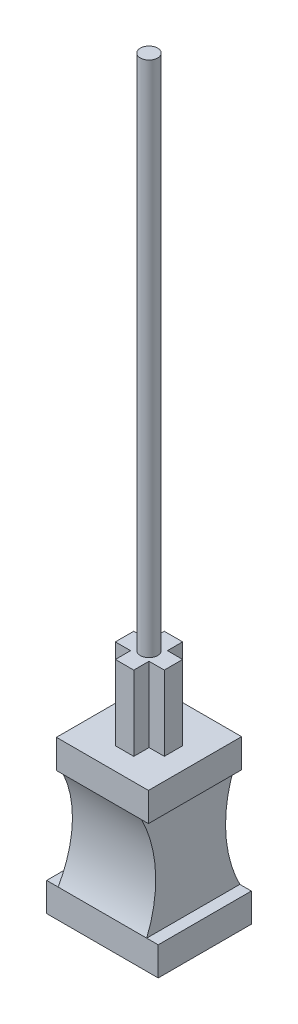
ISO-10303-21;
HEADER;
FILE_DESCRIPTION(('STEP AP214'),'2;1');
FILE_NAME('part.step','',(''),(''),'','','');
FILE_SCHEMA(('AUTOMOTIVE_DESIGN { 1 0 10303 214 1 1 1 1 }'));
ENDSEC;
DATA;
#1=APPLICATION_CONTEXT('core data for automotive mechanical design processes');
#2=APPLICATION_PROTOCOL_DEFINITION('international standard','automotive_design',2000,#1);
#3=PRODUCT_CONTEXT('',#1,'mechanical');
#4=PRODUCT('Part','Part','',(#3));
#5=PRODUCT_RELATED_PRODUCT_CATEGORY('part','',(#4));
#6=PRODUCT_DEFINITION_FORMATION('','',#4);
#7=PRODUCT_DEFINITION_CONTEXT('part definition',#1,'design');
#8=PRODUCT_DEFINITION('design','',#6,#7);
#9=PRODUCT_DEFINITION_SHAPE('','',#8);
#10=(LENGTH_UNIT() NAMED_UNIT(*) SI_UNIT(.MILLI.,.METRE.));
#11=(NAMED_UNIT(*) PLANE_ANGLE_UNIT() SI_UNIT($,.RADIAN.));
#12=(NAMED_UNIT(*) SI_UNIT($,.STERADIAN.) SOLID_ANGLE_UNIT());
#13=UNCERTAINTY_MEASURE_WITH_UNIT(LENGTH_MEASURE(1.E-05),#10,'distance_accuracy_value','');
#14=(GEOMETRIC_REPRESENTATION_CONTEXT(3) GLOBAL_UNCERTAINTY_ASSIGNED_CONTEXT((#13)) GLOBAL_UNIT_ASSIGNED_CONTEXT((#10,
#11,#12)) REPRESENTATION_CONTEXT('',''));
#15=CARTESIAN_POINT('',(0.,0.,0.));
#16=DIRECTION('',(0.,0.,1.));
#17=DIRECTION('',(1.,0.,0.));
#18=AXIS2_PLACEMENT_3D('',#15,#16,#17);
#19=CARTESIAN_POINT('',(0.85,13.7,8.1));
#20=DIRECTION('',(0.,1.,0.));
#21=DIRECTION('',(-1.,0.,0.));
#22=AXIS2_PLACEMENT_3D('',#19,#20,#21);
#23=PLANE('',#22);
#24=DIRECTION('',(1.,0.,0.));
#25=VECTOR('',#24,1.);
#26=CARTESIAN_POINT('',(0.85,13.7,0.));
#27=LINE('',#26,#25);
#28=CARTESIAN_POINT('',(0.85,13.7,0.));
#29=VERTEX_POINT('',#28);
#30=CARTESIAN_POINT('',(8.85,13.7,0.));
#31=VERTEX_POINT('',#30);
#32=EDGE_CURVE('E300',#29,#31,#27,.T.);
#33=ORIENTED_EDGE('',*,*,#32,.F.);
#34=DIRECTION('',(0.,0.,-1.));
#35=VECTOR('',#34,1.);
#36=CARTESIAN_POINT('',(0.85,13.7,8.1));
#37=LINE('',#36,#35);
#38=CARTESIAN_POINT('',(0.85,13.7,8.1));
#39=VERTEX_POINT('',#38);
#40=EDGE_CURVE('E347',#39,#29,#37,.T.);
#41=ORIENTED_EDGE('',*,*,#40,.F.);
#42=DIRECTION('',(1.,0.,0.));
#43=VECTOR('',#42,1.);
#44=CARTESIAN_POINT('',(0.85,13.7,8.1));
#45=LINE('',#44,#43);
#46=CARTESIAN_POINT('',(8.85,13.7,8.1));
#47=VERTEX_POINT('',#46);
#48=EDGE_CURVE('E267',#39,#47,#45,.T.);
#49=ORIENTED_EDGE('',*,*,#48,.T.);
#50=DIRECTION('',(0.,0.,-1.));
#51=VECTOR('',#50,1.);
#52=CARTESIAN_POINT('',(8.85,13.7,8.1));
#53=LINE('',#52,#51);
#54=EDGE_CURVE('E345',#47,#31,#53,.T.);
#55=ORIENTED_EDGE('',*,*,#54,.T.);
#56=EDGE_LOOP('',(#33,#41,#49,#55));
#57=FACE_BOUND('',#56,.T.);
#58=DIRECTION('',(0.,0.,-1.));
#59=VECTOR('',#58,1.);
#60=CARTESIAN_POINT('',(5.65,13.7,3.25));
#61=LINE('',#60,#59);
#62=CARTESIAN_POINT('',(5.65,13.7,3.25));
#63=VERTEX_POINT('',#62);
#64=CARTESIAN_POINT('',(5.65,13.7,1.925));
#65=VERTEX_POINT('',#64);
#66=EDGE_CURVE('E999',#63,#65,#61,.T.);
#67=ORIENTED_EDGE('',*,*,#66,.F.);
#68=DIRECTION('',(-1.,0.,0.));
#69=VECTOR('',#68,1.);
#70=CARTESIAN_POINT('',(6.975,13.7,3.25));
#71=LINE('',#70,#69);
#72=CARTESIAN_POINT('',(6.975,13.7,3.25));
#73=VERTEX_POINT('',#72);
#74=EDGE_CURVE('E217',#73,#63,#71,.T.);
#75=ORIENTED_EDGE('',*,*,#74,.F.);
#76=DIRECTION('',(0.,0.,-1.));
#77=VECTOR('',#76,1.);
#78=CARTESIAN_POINT('',(6.975,13.7,4.84297343910806));
#79=LINE('',#78,#77);
#80=CARTESIAN_POINT('',(6.975,13.7,4.84297343910806));
#81=VERTEX_POINT('',#80);
#82=EDGE_CURVE('E213',#81,#73,#79,.T.);
#83=ORIENTED_EDGE('',*,*,#82,.F.);
#84=DIRECTION('',(0.999985939048307,0.,-0.00530299025796794));
#85=VECTOR('',#84,1.);
#86=CARTESIAN_POINT('',(5.65,13.7,4.85));
#87=LINE('',#86,#85);
#88=CARTESIAN_POINT('',(5.65,13.7,4.85));
#89=VERTEX_POINT('',#88);
#90=EDGE_CURVE('E1050',#89,#81,#87,.T.);
#91=ORIENTED_EDGE('',*,*,#90,.F.);
#92=DIRECTION('',(0.,0.,-1.));
#93=VECTOR('',#92,1.);
#94=CARTESIAN_POINT('',(5.65,13.7,6.175));
#95=LINE('',#94,#93);
#96=CARTESIAN_POINT('',(5.65,13.7,6.175));
#97=VERTEX_POINT('',#96);
#98=EDGE_CURVE('E1047',#97,#89,#95,.T.);
#99=ORIENTED_EDGE('',*,*,#98,.F.);
#100=DIRECTION('',(1.,0.,0.));
#101=VECTOR('',#100,1.);
#102=CARTESIAN_POINT('',(4.05,13.7,6.175));
#103=LINE('',#102,#101);
#104=CARTESIAN_POINT('',(4.05,13.7,6.175));
#105=VERTEX_POINT('',#104);
#106=EDGE_CURVE('E1044',#105,#97,#103,.T.);
#107=ORIENTED_EDGE('',*,*,#106,.F.);
#108=DIRECTION('',(0.,0.,1.));
#109=VECTOR('',#108,1.);
#110=CARTESIAN_POINT('',(4.05,13.7,4.85));
#111=LINE('',#110,#109);
#112=CARTESIAN_POINT('',(4.05,13.7,4.85));
#113=VERTEX_POINT('',#112);
#114=EDGE_CURVE('E1041',#113,#105,#111,.T.);
#115=ORIENTED_EDGE('',*,*,#114,.F.);
#116=DIRECTION('',(0.999997114626677,0.,-0.00240223610861155));
#117=VECTOR('',#116,1.);
#118=CARTESIAN_POINT('',(2.725,13.7,4.85318297202797));
#119=LINE('',#118,#117);
#120=CARTESIAN_POINT('',(2.725,13.7,4.85318297202797));
#121=VERTEX_POINT('',#120);
#122=EDGE_CURVE('E1038',#121,#113,#119,.T.);
#123=ORIENTED_EDGE('',*,*,#122,.F.);
#124=DIRECTION('',(0.,0.,1.));
#125=VECTOR('',#124,1.);
#126=CARTESIAN_POINT('',(2.725,13.7,3.25));
#127=LINE('',#126,#125);
#128=CARTESIAN_POINT('',(2.725,13.7,3.25));
#129=VERTEX_POINT('',#128);
#130=EDGE_CURVE('E1035',#129,#121,#127,.T.);
#131=ORIENTED_EDGE('',*,*,#130,.F.);
#132=DIRECTION('',(-1.,0.,0.));
#133=VECTOR('',#132,1.);
#134=CARTESIAN_POINT('',(4.05,13.7,3.25));
#135=LINE('',#134,#133);
#136=CARTESIAN_POINT('',(4.05,13.7,3.25));
#137=VERTEX_POINT('',#136);
#138=EDGE_CURVE('E1032',#137,#129,#135,.T.);
#139=ORIENTED_EDGE('',*,*,#138,.F.);
#140=DIRECTION('',(0.,0.,1.));
#141=VECTOR('',#140,1.);
#142=CARTESIAN_POINT('',(4.05,13.7,1.925));
#143=LINE('',#142,#141);
#144=CARTESIAN_POINT('',(4.05,13.7,1.925));
#145=VERTEX_POINT('',#144);
#146=EDGE_CURVE('E1029',#145,#137,#143,.T.);
#147=ORIENTED_EDGE('',*,*,#146,.F.);
#148=DIRECTION('',(-1.,0.,0.));
#149=VECTOR('',#148,1.);
#150=CARTESIAN_POINT('',(5.65,13.7,1.925));
#151=LINE('',#150,#149);
#152=EDGE_CURVE('E1026',#65,#145,#151,.T.);
#153=ORIENTED_EDGE('',*,*,#152,.F.);
#154=EDGE_LOOP('',(#67,#75,#83,#91,#99,#107,#115,#123,#131,#139,#147,#153));
#155=FACE_BOUND('',#154,.T.);
#156=ADVANCED_FACE('F15',(#57,#155),#23,.T.);
#157=CARTESIAN_POINT('',(0.,0.,8.1));
#158=DIRECTION('',(0.,0.,1.));
#159=DIRECTION('',(1.,0.,0.));
#160=AXIS2_PLACEMENT_3D('',#157,#158,#159);
#161=PLANE('',#160);
#162=DIRECTION('',(-1.,0.,0.));
#163=VECTOR('',#162,1.);
#164=CARTESIAN_POINT('',(13.089618817433,11.2,8.1));
#165=LINE('',#164,#163);
#166=CARTESIAN_POINT('',(8.23941176470588,11.2,8.1));
#167=VERTEX_POINT('',#166);
#168=CARTESIAN_POINT('',(1.46058823529412,11.2,8.1));
#169=VERTEX_POINT('',#168);
#170=EDGE_CURVE('E244',#167,#169,#165,.T.);
#171=ORIENTED_EDGE('',*,*,#170,.F.);
#172=DIRECTION('',(-1.,0.,0.));
#173=VECTOR('',#172,1.);
#174=CARTESIAN_POINT('',(8.85,11.2,8.1));
#175=LINE('',#174,#173);
#176=CARTESIAN_POINT('',(8.85,11.2,8.1));
#177=VERTEX_POINT('',#176);
#178=EDGE_CURVE('E273',#177,#167,#175,.T.);
#179=ORIENTED_EDGE('',*,*,#178,.F.);
#180=DIRECTION('',(0.,-1.,0.));
#181=VECTOR('',#180,1.);
#182=CARTESIAN_POINT('',(8.85,11.2,8.1));
#183=LINE('',#182,#181);
#184=EDGE_CURVE('E270',#47,#177,#183,.T.);
#185=ORIENTED_EDGE('',*,*,#184,.F.);
#186=ORIENTED_EDGE('',*,*,#48,.F.);
#187=DIRECTION('',(0.,1.,0.));
#188=VECTOR('',#187,1.);
#189=CARTESIAN_POINT('',(0.85,13.7,8.1));
#190=LINE('',#189,#188);
#191=CARTESIAN_POINT('',(0.850000000000001,11.2,8.1));
#192=VERTEX_POINT('',#191);
#193=EDGE_CURVE('E263',#192,#39,#190,.T.);
#194=ORIENTED_EDGE('',*,*,#193,.F.);
#195=DIRECTION('',(-1.,0.,0.));
#196=VECTOR('',#195,1.);
#197=CARTESIAN_POINT('',(0.850000000000001,11.2,8.1));
#198=LINE('',#197,#196);
#199=EDGE_CURVE('E260',#169,#192,#198,.T.);
#200=ORIENTED_EDGE('',*,*,#199,.F.);
#201=EDGE_LOOP('',(#171,#179,#185,#186,#194,#200));
#202=FACE_BOUND('',#201,.T.);
#203=ADVANCED_FACE('F384',(#202),#161,.T.);
#204=CARTESIAN_POINT('',(0.,0.,0.));
#205=DIRECTION('',(0.,0.,1.));
#206=DIRECTION('',(1.,0.,0.));
#207=AXIS2_PLACEMENT_3D('',#204,#205,#206);
#208=PLANE('',#207);
#209=DIRECTION('',(-1.,0.,0.));
#210=VECTOR('',#209,1.);
#211=CARTESIAN_POINT('',(8.85,11.2,0.));
#212=LINE('',#211,#210);
#213=CARTESIAN_POINT('',(8.85,11.2,0.));
#214=VERTEX_POINT('',#213);
#215=CARTESIAN_POINT('',(8.23941176470588,11.2,0.));
#216=VERTEX_POINT('',#215);
#217=EDGE_CURVE('E308',#214,#216,#212,.T.);
#218=ORIENTED_EDGE('',*,*,#217,.T.);
#219=DIRECTION('',(-1.,0.,0.));
#220=VECTOR('',#219,1.);
#221=CARTESIAN_POINT('',(13.089618817433,11.2,0.));
#222=LINE('',#221,#220);
#223=CARTESIAN_POINT('',(1.46058823529412,11.2,0.));
#224=VERTEX_POINT('',#223);
#225=EDGE_CURVE('E241',#216,#224,#222,.T.);
#226=ORIENTED_EDGE('',*,*,#225,.T.);
#227=DIRECTION('',(-1.,0.,0.));
#228=VECTOR('',#227,1.);
#229=CARTESIAN_POINT('',(0.850000000000001,11.2,0.));
#230=LINE('',#229,#228);
#231=CARTESIAN_POINT('',(0.850000000000001,11.2,0.));
#232=VERTEX_POINT('',#231);
#233=EDGE_CURVE('E292',#224,#232,#230,.T.);
#234=ORIENTED_EDGE('',*,*,#233,.T.);
#235=DIRECTION('',(0.,1.,0.));
#236=VECTOR('',#235,1.);
#237=CARTESIAN_POINT('',(0.85,13.7,0.));
#238=LINE('',#237,#236);
#239=EDGE_CURVE('E296',#232,#29,#238,.T.);
#240=ORIENTED_EDGE('',*,*,#239,.T.);
#241=ORIENTED_EDGE('',*,*,#32,.T.);
#242=DIRECTION('',(0.,-1.,0.));
#243=VECTOR('',#242,1.);
#244=CARTESIAN_POINT('',(8.85,11.2,0.));
#245=LINE('',#244,#243);
#246=EDGE_CURVE('E304',#31,#214,#245,.T.);
#247=ORIENTED_EDGE('',*,*,#246,.T.);
#248=EDGE_LOOP('',(#218,#226,#234,#240,#241,#247));
#249=FACE_BOUND('',#248,.T.);
#250=ADVANCED_FACE('F390',(#249),#208,.F.);
#251=CARTESIAN_POINT('',(0.,2.5,8.1));
#252=DIRECTION('',(0.,1.,0.));
#253=DIRECTION('',(0.,0.,1.));
#254=AXIS2_PLACEMENT_3D('',#251,#252,#253);
#255=PLANE('',#254);
#256=DIRECTION('',(1.,0.,0.));
#257=VECTOR('',#256,1.);
#258=CARTESIAN_POINT('',(0.,2.5,0.));
#259=LINE('',#258,#257);
#260=CARTESIAN_POINT('',(0.,2.5,0.));
#261=VERTEX_POINT('',#260);
#262=CARTESIAN_POINT('',(1.,2.5,0.));
#263=VERTEX_POINT('',#262);
#264=EDGE_CURVE('E259',#261,#263,#259,.T.);
#265=ORIENTED_EDGE('',*,*,#264,.F.);
#266=DIRECTION('',(0.,0.,-1.));
#267=VECTOR('',#266,1.);
#268=CARTESIAN_POINT('',(0.,2.5,8.1));
#269=LINE('',#268,#267);
#270=CARTESIAN_POINT('',(0.,2.5,8.1));
#271=VERTEX_POINT('',#270);
#272=EDGE_CURVE('E288',#271,#261,#269,.T.);
#273=ORIENTED_EDGE('',*,*,#272,.F.);
#274=DIRECTION('',(1.,0.,0.));
#275=VECTOR('',#274,1.);
#276=CARTESIAN_POINT('',(0.,2.5,8.1));
#277=LINE('',#276,#275);
#278=CARTESIAN_POINT('',(1.,2.5,8.1));
#279=VERTEX_POINT('',#278);
#280=EDGE_CURVE('E264',#271,#279,#277,.T.);
#281=ORIENTED_EDGE('',*,*,#280,.T.);
#282=DIRECTION('',(0.,0.,-1.));
#283=VECTOR('',#282,1.);
#284=CARTESIAN_POINT('',(1.,2.5,8.1));
#285=LINE('',#284,#283);
#286=EDGE_CURVE('E354',#279,#263,#285,.T.);
#287=ORIENTED_EDGE('',*,*,#286,.T.);
#288=EDGE_LOOP('',(#265,#273,#281,#287));
#289=FACE_BOUND('',#288,.T.);
#290=ADVANCED_FACE('F17',(#289),#255,.T.);
#291=CARTESIAN_POINT('',(1.,2.5,8.1));
#292=DIRECTION('',(-0.998601554869442,0.052867141140147,0.));
#293=DIRECTION('',(-0.052867141140147,-0.998601554869442,0.));
#294=AXIS2_PLACEMENT_3D('',#291,#292,#293);
#295=PLANE('',#294);
#296=CARTESIAN_POINT('',(1.23029411764706,6.85,-8.96125000000001));
#297=DIRECTION('',(-0.998601554869442,0.052867141140147,0.));
#298=DIRECTION('',(-0.052867141140147,-0.998601554869442,0.));
#299=AXIS2_PLACEMENT_3D('',#296,#297,#298);
#300=ELLIPSE('',#299,9.97519976954407,9.96125000000001);
#301=EDGE_CURVE('E253',#263,#224,#300,.T.);
#302=ORIENTED_EDGE('',*,*,#301,.F.);
#303=ORIENTED_EDGE('',*,*,#286,.F.);
#304=CARTESIAN_POINT('',(1.23029411764706,6.85,17.06125));
#305=DIRECTION('',(-0.998601554869442,0.052867141140147,0.));
#306=DIRECTION('',(-0.052867141140147,-0.998601554869442,0.));
#307=AXIS2_PLACEMENT_3D('',#304,#305,#306);
#308=ELLIPSE('',#307,9.97519976954405,9.96124999999999);
#309=EDGE_CURVE('E257',#169,#279,#308,.T.);
#310=ORIENTED_EDGE('',*,*,#309,.F.);
#311=DIRECTION('',(0.,0.,-1.));
#312=VECTOR('',#311,1.);
#313=CARTESIAN_POINT('',(1.46058823529412,11.2,8.1));
#314=LINE('',#313,#312);
#315=EDGE_CURVE('E351',#169,#224,#314,.T.);
#316=ORIENTED_EDGE('',*,*,#315,.T.);
#317=EDGE_LOOP('',(#302,#303,#310,#316));
#318=FACE_BOUND('',#317,.T.);
#319=ADVANCED_FACE('F406',(#318),#295,.T.);
#320=CARTESIAN_POINT('',(0.850000000000001,11.2,8.1));
#321=DIRECTION('',(0.,-1.,0.));
#322=DIRECTION('',(1.,0.,0.));
#323=AXIS2_PLACEMENT_3D('',#320,#321,#322);
#324=PLANE('',#323);
#325=ORIENTED_EDGE('',*,*,#233,.F.);
#326=ORIENTED_EDGE('',*,*,#315,.F.);
#327=ORIENTED_EDGE('',*,*,#199,.T.);
#328=DIRECTION('',(0.,0.,-1.));
#329=VECTOR('',#328,1.);
#330=CARTESIAN_POINT('',(0.850000000000001,11.2,8.1));
#331=LINE('',#330,#329);
#332=EDGE_CURVE('E349',#192,#232,#331,.T.);
#333=ORIENTED_EDGE('',*,*,#332,.T.);
#334=EDGE_LOOP('',(#325,#326,#327,#333));
#335=FACE_BOUND('',#334,.T.);
#336=ADVANCED_FACE('F403',(#335),#324,.T.);
#337=CARTESIAN_POINT('',(0.85,13.7,8.1));
#338=DIRECTION('',(-1.,0.,0.));
#339=DIRECTION('',(0.,-1.,0.));
#340=AXIS2_PLACEMENT_3D('',#337,#338,#339);
#341=PLANE('',#340);
#342=ORIENTED_EDGE('',*,*,#239,.F.);
#343=ORIENTED_EDGE('',*,*,#332,.F.);
#344=ORIENTED_EDGE('',*,*,#193,.T.);
#345=ORIENTED_EDGE('',*,*,#40,.T.);
#346=EDGE_LOOP('',(#342,#343,#344,#345));
#347=FACE_BOUND('',#346,.T.);
#348=ADVANCED_FACE('F400',(#347),#341,.T.);
#349=CARTESIAN_POINT('',(8.85,11.2,8.1));
#350=DIRECTION('',(1.,0.,0.));
#351=DIRECTION('',(0.,0.,-1.));
#352=AXIS2_PLACEMENT_3D('',#349,#350,#351);
#353=PLANE('',#352);
#354=ORIENTED_EDGE('',*,*,#246,.F.);
#355=ORIENTED_EDGE('',*,*,#54,.F.);
#356=ORIENTED_EDGE('',*,*,#184,.T.);
#357=DIRECTION('',(0.,0.,-1.));
#358=VECTOR('',#357,1.);
#359=CARTESIAN_POINT('',(8.85,11.2,8.1));
#360=LINE('',#359,#358);
#361=EDGE_CURVE('E343',#177,#214,#360,.T.);
#362=ORIENTED_EDGE('',*,*,#361,.T.);
#363=EDGE_LOOP('',(#354,#355,#356,#362));
#364=FACE_BOUND('',#363,.T.);
#365=ADVANCED_FACE('F398',(#364),#353,.T.);
#366=CARTESIAN_POINT('',(8.85,11.2,8.1));
#367=DIRECTION('',(0.,-1.,0.));
#368=DIRECTION('',(0.,0.,-1.));
#369=AXIS2_PLACEMENT_3D('',#366,#367,#368);
#370=PLANE('',#369);
#371=ORIENTED_EDGE('',*,*,#217,.F.);
#372=ORIENTED_EDGE('',*,*,#361,.F.);
#373=ORIENTED_EDGE('',*,*,#178,.T.);
#374=DIRECTION('',(0.,0.,-1.));
#375=VECTOR('',#374,1.);
#376=CARTESIAN_POINT('',(8.23941176470588,11.2,8.1));
#377=LINE('',#376,#375);
#378=EDGE_CURVE('E340',#167,#216,#377,.T.);
#379=ORIENTED_EDGE('',*,*,#378,.T.);
#380=EDGE_LOOP('',(#371,#372,#373,#379));
#381=FACE_BOUND('',#380,.T.);
#382=ADVANCED_FACE('F463',(#381),#370,.T.);
#383=CARTESIAN_POINT('',(8.7,2.5,8.1));
#384=DIRECTION('',(0.998601554869442,0.0528671411401469,0.));
#385=DIRECTION('',(-0.0528671411401469,0.998601554869442,0.));
#386=AXIS2_PLACEMENT_3D('',#383,#384,#385);
#387=PLANE('',#386);
#388=CARTESIAN_POINT('',(8.46970588235294,6.85,-8.96125000000001));
#389=DIRECTION('',(0.998601554869442,0.0528671411401469,0.));
#390=DIRECTION('',(-0.0528671411401469,0.998601554869442,0.));
#391=AXIS2_PLACEMENT_3D('',#388,#389,#390);
#392=ELLIPSE('',#391,9.97519976954407,9.96125000000001);
#393=CARTESIAN_POINT('',(8.7,2.5,0.));
#394=VERTEX_POINT('',#393);
#395=EDGE_CURVE('E251',#216,#394,#392,.T.);
#396=ORIENTED_EDGE('',*,*,#395,.F.);
#397=ORIENTED_EDGE('',*,*,#378,.F.);
#398=CARTESIAN_POINT('',(8.46970588235294,6.85,17.06125));
#399=DIRECTION('',(0.998601554869442,0.0528671411401469,0.));
#400=DIRECTION('',(-0.0528671411401469,0.998601554869442,0.));
#401=AXIS2_PLACEMENT_3D('',#398,#399,#400);
#402=ELLIPSE('',#401,9.97519976954405,9.96124999999999);
#403=CARTESIAN_POINT('',(8.7,2.5,8.1));
#404=VERTEX_POINT('',#403);
#405=EDGE_CURVE('E255',#404,#167,#402,.T.);
#406=ORIENTED_EDGE('',*,*,#405,.F.);
#407=DIRECTION('',(0.,0.,-1.));
#408=VECTOR('',#407,1.);
#409=CARTESIAN_POINT('',(8.7,2.5,8.1));
#410=LINE('',#409,#408);
#411=EDGE_CURVE('E337',#404,#394,#410,.T.);
#412=ORIENTED_EDGE('',*,*,#411,.T.);
#413=EDGE_LOOP('',(#396,#397,#406,#412));
#414=FACE_BOUND('',#413,.T.);
#415=ADVANCED_FACE('F441',(#414),#387,.T.);
#416=CARTESIAN_POINT('',(9.7,2.5,8.1));
#417=DIRECTION('',(0.,1.,0.));
#418=DIRECTION('',(0.,0.,1.));
#419=AXIS2_PLACEMENT_3D('',#416,#417,#418);
#420=PLANE('',#419);
#421=DIRECTION('',(1.,0.,0.));
#422=VECTOR('',#421,1.);
#423=CARTESIAN_POINT('',(9.7,2.5,0.));
#424=LINE('',#423,#422);
#425=CARTESIAN_POINT('',(9.7,2.5,0.));
#426=VERTEX_POINT('',#425);
#427=EDGE_CURVE('E312',#394,#426,#424,.T.);
#428=ORIENTED_EDGE('',*,*,#427,.F.);
#429=ORIENTED_EDGE('',*,*,#411,.F.);
#430=DIRECTION('',(1.,0.,0.));
#431=VECTOR('',#430,1.);
#432=CARTESIAN_POINT('',(9.7,2.5,8.1));
#433=LINE('',#432,#431);
#434=CARTESIAN_POINT('',(9.7,2.5,8.1));
#435=VERTEX_POINT('',#434);
#436=EDGE_CURVE('E276',#404,#435,#433,.T.);
#437=ORIENTED_EDGE('',*,*,#436,.T.);
#438=DIRECTION('',(0.,0.,-1.));
#439=VECTOR('',#438,1.);
#440=CARTESIAN_POINT('',(9.7,2.5,8.1));
#441=LINE('',#440,#439);
#442=EDGE_CURVE('E335',#435,#426,#441,.T.);
#443=ORIENTED_EDGE('',*,*,#442,.T.);
#444=EDGE_LOOP('',(#428,#429,#437,#443));
#445=FACE_BOUND('',#444,.T.);
#446=ADVANCED_FACE('F444',(#445),#420,.T.);
#447=CARTESIAN_POINT('',(9.7,0.,8.1));
#448=DIRECTION('',(1.,0.,0.));
#449=DIRECTION('',(0.,0.,-1.));
#450=AXIS2_PLACEMENT_3D('',#447,#448,#449);
#451=PLANE('',#450);
#452=DIRECTION('',(0.,-1.,0.));
#453=VECTOR('',#452,1.);
#454=CARTESIAN_POINT('',(9.7,0.,0.));
#455=LINE('',#454,#453);
#456=CARTESIAN_POINT('',(9.7,0.,0.));
#457=VERTEX_POINT('',#456);
#458=EDGE_CURVE('E316',#426,#457,#455,.T.);
#459=ORIENTED_EDGE('',*,*,#458,.F.);
#460=ORIENTED_EDGE('',*,*,#442,.F.);
#461=DIRECTION('',(0.,-1.,0.));
#462=VECTOR('',#461,1.);
#463=CARTESIAN_POINT('',(9.7,0.,8.1));
#464=LINE('',#463,#462);
#465=CARTESIAN_POINT('',(9.7,0.,8.1));
#466=VERTEX_POINT('',#465);
#467=EDGE_CURVE('E279',#435,#466,#464,.T.);
#468=ORIENTED_EDGE('',*,*,#467,.T.);
#469=DIRECTION('',(0.,0.,-1.));
#470=VECTOR('',#469,1.);
#471=CARTESIAN_POINT('',(9.7,0.,8.1));
#472=LINE('',#471,#470);
#473=EDGE_CURVE('E333',#466,#457,#472,.T.);
#474=ORIENTED_EDGE('',*,*,#473,.T.);
#475=EDGE_LOOP('',(#459,#460,#468,#474));
#476=FACE_BOUND('',#475,.T.);
#477=ADVANCED_FACE('F447',(#476),#451,.T.);
#478=CARTESIAN_POINT('',(0.,0.,8.1));
#479=DIRECTION('',(0.,-1.,0.));
#480=DIRECTION('',(0.,0.,-1.));
#481=AXIS2_PLACEMENT_3D('',#478,#479,#480);
#482=PLANE('',#481);
#483=DIRECTION('',(-1.,0.,0.));
#484=VECTOR('',#483,1.);
#485=CARTESIAN_POINT('',(0.,0.,0.));
#486=LINE('',#485,#484);
#487=CARTESIAN_POINT('',(0.,0.,0.));
#488=VERTEX_POINT('',#487);
#489=EDGE_CURVE('E320',#457,#488,#486,.T.);
#490=ORIENTED_EDGE('',*,*,#489,.F.);
#491=ORIENTED_EDGE('',*,*,#473,.F.);
#492=DIRECTION('',(-1.,0.,0.));
#493=VECTOR('',#492,1.);
#494=CARTESIAN_POINT('',(0.,0.,8.1));
#495=LINE('',#494,#493);
#496=CARTESIAN_POINT('',(0.,0.,8.1));
#497=VERTEX_POINT('',#496);
#498=EDGE_CURVE('E282',#466,#497,#495,.T.);
#499=ORIENTED_EDGE('',*,*,#498,.T.);
#500=DIRECTION('',(0.,0.,-1.));
#501=VECTOR('',#500,1.);
#502=CARTESIAN_POINT('',(0.,0.,8.1));
#503=LINE('',#502,#501);
#504=EDGE_CURVE('E331',#497,#488,#503,.T.);
#505=ORIENTED_EDGE('',*,*,#504,.T.);
#506=EDGE_LOOP('',(#490,#491,#499,#505));
#507=FACE_BOUND('',#506,.T.);
#508=ADVANCED_FACE('F449',(#507),#482,.T.);
#509=CARTESIAN_POINT('',(0.,2.5,8.1));
#510=DIRECTION('',(-1.,0.,0.));
#511=DIRECTION('',(0.,-1.,0.));
#512=AXIS2_PLACEMENT_3D('',#509,#510,#511);
#513=PLANE('',#512);
#514=DIRECTION('',(0.,1.,0.));
#515=VECTOR('',#514,1.);
#516=CARTESIAN_POINT('',(0.,2.5,0.));
#517=LINE('',#516,#515);
#518=EDGE_CURVE('E291',#488,#261,#517,.T.);
#519=ORIENTED_EDGE('',*,*,#518,.F.);
#520=ORIENTED_EDGE('',*,*,#504,.F.);
#521=DIRECTION('',(0.,1.,0.));
#522=VECTOR('',#521,1.);
#523=CARTESIAN_POINT('',(0.,2.5,8.1));
#524=LINE('',#523,#522);
#525=EDGE_CURVE('E285',#497,#271,#524,.T.);
#526=ORIENTED_EDGE('',*,*,#525,.T.);
#527=ORIENTED_EDGE('',*,*,#272,.T.);
#528=EDGE_LOOP('',(#519,#520,#526,#527));
#529=FACE_BOUND('',#528,.T.);
#530=ADVANCED_FACE('F427',(#529),#513,.T.);
#531=DIRECTION('',(-1.,0.,0.));
#532=VECTOR('',#531,1.);
#533=CARTESIAN_POINT('',(13.089618817433,2.5,8.1));
#534=LINE('',#533,#532);
#535=EDGE_CURVE('E246',#404,#279,#534,.T.);
#536=ORIENTED_EDGE('',*,*,#535,.T.);
#537=ORIENTED_EDGE('',*,*,#280,.F.);
#538=ORIENTED_EDGE('',*,*,#525,.F.);
#539=ORIENTED_EDGE('',*,*,#498,.F.);
#540=ORIENTED_EDGE('',*,*,#467,.F.);
#541=ORIENTED_EDGE('',*,*,#436,.F.);
#542=EDGE_LOOP('',(#536,#537,#538,#539,#540,#541));
#543=FACE_BOUND('',#542,.T.);
#544=ADVANCED_FACE('F393',(#543),#161,.T.);
#545=ORIENTED_EDGE('',*,*,#264,.T.);
#546=DIRECTION('',(-1.,0.,0.));
#547=VECTOR('',#546,1.);
#548=CARTESIAN_POINT('',(13.089618817433,2.5,0.));
#549=LINE('',#548,#547);
#550=EDGE_CURVE('E249',#394,#263,#549,.T.);
#551=ORIENTED_EDGE('',*,*,#550,.F.);
#552=ORIENTED_EDGE('',*,*,#427,.T.);
#553=ORIENTED_EDGE('',*,*,#458,.T.);
#554=ORIENTED_EDGE('',*,*,#489,.T.);
#555=ORIENTED_EDGE('',*,*,#518,.T.);
#556=EDGE_LOOP('',(#545,#551,#552,#553,#554,#555));
#557=FACE_BOUND('',#556,.T.);
#558=ADVANCED_FACE('F423',(#557),#208,.F.);
#559=CARTESIAN_POINT('',(13.089618817433,6.85,-8.96125000000001));
#560=DIRECTION('',(-1.,0.,0.));
#561=DIRECTION('',(0.,0.,1.));
#562=AXIS2_PLACEMENT_3D('',#559,#560,#561);
#563=CYLINDRICAL_SURFACE('',#562,9.96125000000001);
#564=CARTESIAN_POINT('',(6.1,6.85,-8.96125000000001));
#565=DIRECTION('',(0.949945114877179,0.312416834887274,0.));
#566=DIRECTION('',(-0.312416834887274,0.949945114877179,0.));
#567=AXIS2_PLACEMENT_3D('',#564,#565,#566);
#568=ELLIPSE('',#567,10.486132139632,9.96125000000001);
#569=CARTESIAN_POINT('',(6.1,6.85,0.999999999999999));
#570=VERTEX_POINT('',#569);
#571=CARTESIAN_POINT('',(4.85,10.650791958042,0.246381728853167));
#572=VERTEX_POINT('',#571);
#573=EDGE_CURVE('E23',#570,#572,#568,.F.);
#574=ORIENTED_EDGE('',*,*,#573,.T.);
#575=CARTESIAN_POINT('',(3.6,6.85,-8.96125000000001));
#576=DIRECTION('',(-0.949945114877179,0.312416834887274,0.));
#577=DIRECTION('',(-0.312416834887274,-0.949945114877179,0.));
#578=AXIS2_PLACEMENT_3D('',#575,#576,#577);
#579=ELLIPSE('',#578,10.486132139632,9.96125000000001);
#580=CARTESIAN_POINT('',(3.6,6.85,0.999999999999999));
#581=VERTEX_POINT('',#580);
#582=EDGE_CURVE('E9',#572,#581,#579,.F.);
#583=ORIENTED_EDGE('',*,*,#582,.T.);
#584=DIRECTION('',(-1.,0.,0.));
#585=VECTOR('',#584,1.);
#586=CARTESIAN_POINT('',(13.089618817433,6.85,0.999999999999999));
#587=LINE('',#586,#585);
#588=EDGE_CURVE('E357',#581,#570,#587,.F.);
#589=ORIENTED_EDGE('',*,*,#588,.T.);
#590=EDGE_LOOP('',(#574,#583,#589));
#591=FACE_BOUND('',#590,.T.);
#592=ORIENTED_EDGE('',*,*,#301,.T.);
#593=ORIENTED_EDGE('',*,*,#225,.F.);
#594=ORIENTED_EDGE('',*,*,#395,.T.);
#595=ORIENTED_EDGE('',*,*,#550,.T.);
#596=EDGE_LOOP('',(#592,#593,#594,#595));
#597=FACE_BOUND('',#596,.T.);
#598=ADVANCED_FACE('F361',(#591,#597),#563,.F.);
#599=CARTESIAN_POINT('',(13.089618817433,6.85,17.06125));
#600=DIRECTION('',(-1.,0.,0.));
#601=DIRECTION('',(0.,0.,1.));
#602=AXIS2_PLACEMENT_3D('',#599,#600,#601);
#603=CYLINDRICAL_SURFACE('',#602,9.96124999999999);
#604=ORIENTED_EDGE('',*,*,#309,.T.);
#605=ORIENTED_EDGE('',*,*,#535,.F.);
#606=ORIENTED_EDGE('',*,*,#405,.T.);
#607=ORIENTED_EDGE('',*,*,#170,.T.);
#608=EDGE_LOOP('',(#604,#605,#606,#607));
#609=FACE_BOUND('',#608,.T.);
#610=ADVANCED_FACE('F435',(#609),#603,.F.);
#611=CARTESIAN_POINT('',(3.6,6.85,2.61222283925827));
#612=DIRECTION('',(-0.949945114877179,0.312416834887274,0.));
#613=DIRECTION('',(-0.312416834887274,-0.949945114877179,0.));
#614=AXIS2_PLACEMENT_3D('',#611,#612,#613);
#615=PLANE('',#614);
#616=ORIENTED_EDGE('',*,*,#582,.F.);
#617=DIRECTION('',(0.,0.,-1.));
#618=VECTOR('',#617,1.);
#619=CARTESIAN_POINT('',(4.85,10.650791958042,2.61222283925827));
#620=LINE('',#619,#618);
#621=CARTESIAN_POINT('',(4.85,10.650791958042,0.));
#622=VERTEX_POINT('',#621);
#623=EDGE_CURVE('E237',#572,#622,#620,.T.);
#624=ORIENTED_EDGE('',*,*,#623,.T.);
#625=DIRECTION('',(0.312416834887274,0.949945114877179,0.));
#626=VECTOR('',#625,1.);
#627=CARTESIAN_POINT('',(3.6,6.85,0.));
#628=LINE('',#627,#626);
#629=CARTESIAN_POINT('',(3.6,6.85,0.));
#630=VERTEX_POINT('',#629);
#631=EDGE_CURVE('E219',#630,#622,#628,.T.);
#632=ORIENTED_EDGE('',*,*,#631,.F.);
#633=DIRECTION('',(0.,0.,-1.));
#634=VECTOR('',#633,1.);
#635=CARTESIAN_POINT('',(3.6,6.85,2.61222283925827));
#636=LINE('',#635,#634);
#637=EDGE_CURVE('E239',#581,#630,#636,.T.);
#638=ORIENTED_EDGE('',*,*,#637,.F.);
#639=EDGE_LOOP('',(#616,#624,#632,#638));
#640=FACE_BOUND('',#639,.T.);
#641=ADVANCED_FACE('F369',(#640),#615,.T.);
#642=CARTESIAN_POINT('',(4.85,10.650791958042,2.61222283925827));
#643=DIRECTION('',(0.949945114877179,0.312416834887274,0.));
#644=DIRECTION('',(-0.312416834887274,0.949945114877179,0.));
#645=AXIS2_PLACEMENT_3D('',#642,#643,#644);
#646=PLANE('',#645);
#647=ORIENTED_EDGE('',*,*,#573,.F.);
#648=DIRECTION('',(0.,0.,-1.));
#649=VECTOR('',#648,1.);
#650=CARTESIAN_POINT('',(6.1,6.85,2.61222283925827));
#651=LINE('',#650,#649);
#652=CARTESIAN_POINT('',(6.1,6.85,0.));
#653=VERTEX_POINT('',#652);
#654=EDGE_CURVE('E38',#570,#653,#651,.T.);
#655=ORIENTED_EDGE('',*,*,#654,.T.);
#656=DIRECTION('',(0.312416834887274,-0.949945114877179,0.));
#657=VECTOR('',#656,1.);
#658=CARTESIAN_POINT('',(4.85,10.650791958042,0.));
#659=LINE('',#658,#657);
#660=EDGE_CURVE('E223',#622,#653,#659,.T.);
#661=ORIENTED_EDGE('',*,*,#660,.F.);
#662=ORIENTED_EDGE('',*,*,#623,.F.);
#663=EDGE_LOOP('',(#647,#655,#661,#662));
#664=FACE_BOUND('',#663,.T.);
#665=ADVANCED_FACE('F365',(#664),#646,.T.);
#666=CARTESIAN_POINT('',(4.85,6.85,2.61222283925827));
#667=DIRECTION('',(0.,-1.,0.));
#668=DIRECTION('',(0.,0.,-1.));
#669=AXIS2_PLACEMENT_3D('',#666,#667,#668);
#670=PLANE('',#669);
#671=ORIENTED_EDGE('',*,*,#588,.F.);
#672=ORIENTED_EDGE('',*,*,#637,.T.);
#673=DIRECTION('',(-1.,0.,0.));
#674=VECTOR('',#673,1.);
#675=CARTESIAN_POINT('',(4.85,6.85,0.));
#676=LINE('',#675,#674);
#677=EDGE_CURVE('E232',#653,#630,#676,.T.);
#678=ORIENTED_EDGE('',*,*,#677,.F.);
#679=ORIENTED_EDGE('',*,*,#654,.F.);
#680=EDGE_LOOP('',(#671,#672,#678,#679));
#681=FACE_BOUND('',#680,.T.);
#682=ADVANCED_FACE('F371',(#681),#670,.T.);
#683=CARTESIAN_POINT('',(0.,0.,0.));
#684=DIRECTION('',(0.,0.,-1.));
#685=DIRECTION('',(-1.,0.,0.));
#686=AXIS2_PLACEMENT_3D('',#683,#684,#685);
#687=PLANE('',#686);
#688=ORIENTED_EDGE('',*,*,#677,.T.);
#689=ORIENTED_EDGE('',*,*,#631,.T.);
#690=ORIENTED_EDGE('',*,*,#660,.T.);
#691=EDGE_LOOP('',(#688,#689,#690));
#692=FACE_BOUND('',#691,.T.);
#693=ADVANCED_FACE('F373',(#692),#687,.T.);
#694=CARTESIAN_POINT('',(6.975,20.2,3.25));
#695=DIRECTION('',(0.,0.,1.));
#696=DIRECTION('',(1.,0.,0.));
#697=AXIS2_PLACEMENT_3D('',#694,#695,#696);
#698=PLANE('',#697);
#699=ORIENTED_EDGE('',*,*,#74,.T.);
#700=DIRECTION('',(0.,-1.,0.));
#701=VECTOR('',#700,1.);
#702=CARTESIAN_POINT('',(5.65,20.2,3.25));
#703=LINE('',#702,#701);
#704=CARTESIAN_POINT('',(5.65,20.2,3.25));
#705=VERTEX_POINT('',#704);
#706=EDGE_CURVE('E198',#705,#63,#703,.T.);
#707=ORIENTED_EDGE('',*,*,#706,.F.);
#708=DIRECTION('',(-1.,0.,0.));
#709=VECTOR('',#708,1.);
#710=CARTESIAN_POINT('',(6.975,20.2,3.25));
#711=LINE('',#710,#709);
#712=CARTESIAN_POINT('',(6.975,20.2,3.25));
#713=VERTEX_POINT('',#712);
#714=EDGE_CURVE('E205',#713,#705,#711,.T.);
#715=ORIENTED_EDGE('',*,*,#714,.F.);
#716=DIRECTION('',(0.,-1.,0.));
#717=VECTOR('',#716,1.);
#718=CARTESIAN_POINT('',(6.975,20.2,3.25));
#719=LINE('',#718,#717);
#720=EDGE_CURVE('E1022',#713,#73,#719,.T.);
#721=ORIENTED_EDGE('',*,*,#720,.T.);
#722=EDGE_LOOP('',(#699,#707,#715,#721));
#723=FACE_BOUND('',#722,.T.);
#724=ADVANCED_FACE('F215',(#723),#698,.F.);
#725=CARTESIAN_POINT('',(5.65,20.2,3.25));
#726=DIRECTION('',(-1.,0.,0.));
#727=DIRECTION('',(0.,0.,1.));
#728=AXIS2_PLACEMENT_3D('',#725,#726,#727);
#729=PLANE('',#728);
#730=ORIENTED_EDGE('',*,*,#66,.T.);
#731=DIRECTION('',(0.,-1.,0.));
#732=VECTOR('',#731,1.);
#733=CARTESIAN_POINT('',(5.65,20.2,1.925));
#734=LINE('',#733,#732);
#735=CARTESIAN_POINT('',(5.65,20.2,1.925));
#736=VERTEX_POINT('',#735);
#737=EDGE_CURVE('E201',#736,#65,#734,.T.);
#738=ORIENTED_EDGE('',*,*,#737,.F.);
#739=DIRECTION('',(0.,0.,-1.));
#740=VECTOR('',#739,1.);
#741=CARTESIAN_POINT('',(5.65,20.2,3.25));
#742=LINE('',#741,#740);
#743=EDGE_CURVE('E194',#705,#736,#742,.T.);
#744=ORIENTED_EDGE('',*,*,#743,.F.);
#745=ORIENTED_EDGE('',*,*,#706,.T.);
#746=EDGE_LOOP('',(#730,#738,#744,#745));
#747=FACE_BOUND('',#746,.T.);
#748=ADVANCED_FACE('F196',(#747),#729,.F.);
#749=CARTESIAN_POINT('',(5.65,20.2,1.925));
#750=DIRECTION('',(0.,0.,1.));
#751=DIRECTION('',(1.,0.,0.));
#752=AXIS2_PLACEMENT_3D('',#749,#750,#751);
#753=PLANE('',#752);
#754=ORIENTED_EDGE('',*,*,#152,.T.);
#755=DIRECTION('',(0.,-1.,0.));
#756=VECTOR('',#755,1.);
#757=CARTESIAN_POINT('',(4.05,20.2,1.925));
#758=LINE('',#757,#756);
#759=CARTESIAN_POINT('',(4.05,20.2,1.925));
#760=VERTEX_POINT('',#759);
#761=EDGE_CURVE('E225',#760,#145,#758,.T.);
#762=ORIENTED_EDGE('',*,*,#761,.F.);
#763=DIRECTION('',(-1.,0.,0.));
#764=VECTOR('',#763,1.);
#765=CARTESIAN_POINT('',(5.65,20.2,1.925));
#766=LINE('',#765,#764);
#767=EDGE_CURVE('E204',#736,#760,#766,.T.);
#768=ORIENTED_EDGE('',*,*,#767,.F.);
#769=ORIENTED_EDGE('',*,*,#737,.T.);
#770=EDGE_LOOP('',(#754,#762,#768,#769));
#771=FACE_BOUND('',#770,.T.);
#772=ADVANCED_FACE('F559',(#771),#753,.F.);
#773=CARTESIAN_POINT('',(4.05,20.2,1.925));
#774=DIRECTION('',(1.,0.,0.));
#775=DIRECTION('',(0.,1.,0.));
#776=AXIS2_PLACEMENT_3D('',#773,#774,#775);
#777=PLANE('',#776);
#778=ORIENTED_EDGE('',*,*,#146,.T.);
#779=DIRECTION('',(0.,-1.,0.));
#780=VECTOR('',#779,1.);
#781=CARTESIAN_POINT('',(4.05,20.2,3.25));
#782=LINE('',#781,#780);
#783=CARTESIAN_POINT('',(4.05,20.2,3.25));
#784=VERTEX_POINT('',#783);
#785=EDGE_CURVE('E1075',#784,#137,#782,.T.);
#786=ORIENTED_EDGE('',*,*,#785,.F.);
#787=DIRECTION('',(0.,0.,1.));
#788=VECTOR('',#787,1.);
#789=CARTESIAN_POINT('',(4.05,20.2,1.925));
#790=LINE('',#789,#788);
#791=EDGE_CURVE('E1006',#760,#784,#790,.T.);
#792=ORIENTED_EDGE('',*,*,#791,.F.);
#793=ORIENTED_EDGE('',*,*,#761,.T.);
#794=EDGE_LOOP('',(#778,#786,#792,#793));
#795=FACE_BOUND('',#794,.T.);
#796=ADVANCED_FACE('F569',(#795),#777,.F.);
#797=CARTESIAN_POINT('',(4.05,20.2,3.25));
#798=DIRECTION('',(0.,0.,1.));
#799=DIRECTION('',(1.,0.,0.));
#800=AXIS2_PLACEMENT_3D('',#797,#798,#799);
#801=PLANE('',#800);
#802=ORIENTED_EDGE('',*,*,#138,.T.);
#803=DIRECTION('',(0.,-1.,0.));
#804=VECTOR('',#803,1.);
#805=CARTESIAN_POINT('',(2.725,20.2,3.25));
#806=LINE('',#805,#804);
#807=CARTESIAN_POINT('',(2.725,20.2,3.25));
#808=VERTEX_POINT('',#807);
#809=EDGE_CURVE('E1072',#808,#129,#806,.T.);
#810=ORIENTED_EDGE('',*,*,#809,.F.);
#811=DIRECTION('',(-1.,0.,0.));
#812=VECTOR('',#811,1.);
#813=CARTESIAN_POINT('',(4.05,20.2,3.25));
#814=LINE('',#813,#812);
#815=EDGE_CURVE('E1008',#784,#808,#814,.T.);
#816=ORIENTED_EDGE('',*,*,#815,.F.);
#817=ORIENTED_EDGE('',*,*,#785,.T.);
#818=EDGE_LOOP('',(#802,#810,#816,#817));
#819=FACE_BOUND('',#818,.T.);
#820=ADVANCED_FACE('F580',(#819),#801,.F.);
#821=CARTESIAN_POINT('',(2.725,20.2,3.25));
#822=DIRECTION('',(1.,0.,0.));
#823=DIRECTION('',(0.,1.,0.));
#824=AXIS2_PLACEMENT_3D('',#821,#822,#823);
#825=PLANE('',#824);
#826=ORIENTED_EDGE('',*,*,#130,.T.);
#827=DIRECTION('',(0.,-1.,0.));
#828=VECTOR('',#827,1.);
#829=CARTESIAN_POINT('',(2.725,20.2,4.85318297202797));
#830=LINE('',#829,#828);
#831=CARTESIAN_POINT('',(2.725,20.2,4.85318297202797));
#832=VERTEX_POINT('',#831);
#833=EDGE_CURVE('E1069',#832,#121,#830,.T.);
#834=ORIENTED_EDGE('',*,*,#833,.F.);
#835=DIRECTION('',(0.,0.,1.));
#836=VECTOR('',#835,1.);
#837=CARTESIAN_POINT('',(2.725,20.2,3.25));
#838=LINE('',#837,#836);
#839=EDGE_CURVE('E1010',#808,#832,#838,.T.);
#840=ORIENTED_EDGE('',*,*,#839,.F.);
#841=ORIENTED_EDGE('',*,*,#809,.T.);
#842=EDGE_LOOP('',(#826,#834,#840,#841));
#843=FACE_BOUND('',#842,.T.);
#844=ADVANCED_FACE('F591',(#843),#825,.F.);
#845=CARTESIAN_POINT('',(2.725,20.2,4.85318297202797));
#846=DIRECTION('',(-0.00240223610861155,0.,-0.999997114626677));
#847=DIRECTION('',(-0.999997114626677,0.,0.00240223610861155));
#848=AXIS2_PLACEMENT_3D('',#845,#846,#847);
#849=PLANE('',#848);
#850=ORIENTED_EDGE('',*,*,#122,.T.);
#851=DIRECTION('',(0.,-1.,0.));
#852=VECTOR('',#851,1.);
#853=CARTESIAN_POINT('',(4.05,20.2,4.85));
#854=LINE('',#853,#852);
#855=CARTESIAN_POINT('',(4.05,20.2,4.85));
#856=VERTEX_POINT('',#855);
#857=EDGE_CURVE('E1066',#856,#113,#854,.T.);
#858=ORIENTED_EDGE('',*,*,#857,.F.);
#859=DIRECTION('',(0.999997114626677,0.,-0.00240223610861155));
#860=VECTOR('',#859,1.);
#861=CARTESIAN_POINT('',(2.725,20.2,4.85318297202797));
#862=LINE('',#861,#860);
#863=EDGE_CURVE('E1012',#832,#856,#862,.T.);
#864=ORIENTED_EDGE('',*,*,#863,.F.);
#865=ORIENTED_EDGE('',*,*,#833,.T.);
#866=EDGE_LOOP('',(#850,#858,#864,#865));
#867=FACE_BOUND('',#866,.T.);
#868=ADVANCED_FACE('F602',(#867),#849,.F.);
#869=CARTESIAN_POINT('',(4.05,20.2,4.85));
#870=DIRECTION('',(1.,0.,0.));
#871=DIRECTION('',(0.,0.,-1.));
#872=AXIS2_PLACEMENT_3D('',#869,#870,#871);
#873=PLANE('',#872);
#874=ORIENTED_EDGE('',*,*,#114,.T.);
#875=DIRECTION('',(0.,-1.,0.));
#876=VECTOR('',#875,1.);
#877=CARTESIAN_POINT('',(4.05,20.2,6.175));
#878=LINE('',#877,#876);
#879=CARTESIAN_POINT('',(4.05,20.2,6.175));
#880=VERTEX_POINT('',#879);
#881=EDGE_CURVE('E1063',#880,#105,#878,.T.);
#882=ORIENTED_EDGE('',*,*,#881,.F.);
#883=DIRECTION('',(0.,0.,1.));
#884=VECTOR('',#883,1.);
#885=CARTESIAN_POINT('',(4.05,20.2,4.85));
#886=LINE('',#885,#884);
#887=EDGE_CURVE('E1014',#856,#880,#886,.T.);
#888=ORIENTED_EDGE('',*,*,#887,.F.);
#889=ORIENTED_EDGE('',*,*,#857,.T.);
#890=EDGE_LOOP('',(#874,#882,#888,#889));
#891=FACE_BOUND('',#890,.T.);
#892=ADVANCED_FACE('F613',(#891),#873,.F.);
#893=CARTESIAN_POINT('',(4.05,20.2,6.175));
#894=DIRECTION('',(0.,0.,-1.));
#895=DIRECTION('',(-1.,0.,0.));
#896=AXIS2_PLACEMENT_3D('',#893,#894,#895);
#897=PLANE('',#896);
#898=ORIENTED_EDGE('',*,*,#106,.T.);
#899=DIRECTION('',(0.,-1.,0.));
#900=VECTOR('',#899,1.);
#901=CARTESIAN_POINT('',(5.65,20.2,6.175));
#902=LINE('',#901,#900);
#903=CARTESIAN_POINT('',(5.65,20.2,6.175));
#904=VERTEX_POINT('',#903);
#905=EDGE_CURVE('E1060',#904,#97,#902,.T.);
#906=ORIENTED_EDGE('',*,*,#905,.F.);
#907=DIRECTION('',(1.,0.,0.));
#908=VECTOR('',#907,1.);
#909=CARTESIAN_POINT('',(4.05,20.2,6.175));
#910=LINE('',#909,#908);
#911=EDGE_CURVE('E1016',#880,#904,#910,.T.);
#912=ORIENTED_EDGE('',*,*,#911,.F.);
#913=ORIENTED_EDGE('',*,*,#881,.T.);
#914=EDGE_LOOP('',(#898,#906,#912,#913));
#915=FACE_BOUND('',#914,.T.);
#916=ADVANCED_FACE('F624',(#915),#897,.F.);
#917=CARTESIAN_POINT('',(5.65,20.2,6.175));
#918=DIRECTION('',(-1.,0.,0.));
#919=DIRECTION('',(0.,-1.,0.));
#920=AXIS2_PLACEMENT_3D('',#917,#918,#919);
#921=PLANE('',#920);
#922=ORIENTED_EDGE('',*,*,#98,.T.);
#923=DIRECTION('',(0.,-1.,0.));
#924=VECTOR('',#923,1.);
#925=CARTESIAN_POINT('',(5.65,20.2,4.85));
#926=LINE('',#925,#924);
#927=CARTESIAN_POINT('',(5.65,20.2,4.85));
#928=VERTEX_POINT('',#927);
#929=EDGE_CURVE('E1057',#928,#89,#926,.T.);
#930=ORIENTED_EDGE('',*,*,#929,.F.);
#931=DIRECTION('',(0.,0.,-1.));
#932=VECTOR('',#931,1.);
#933=CARTESIAN_POINT('',(5.65,20.2,6.175));
#934=LINE('',#933,#932);
#935=EDGE_CURVE('E1018',#904,#928,#934,.T.);
#936=ORIENTED_EDGE('',*,*,#935,.F.);
#937=ORIENTED_EDGE('',*,*,#905,.T.);
#938=EDGE_LOOP('',(#922,#930,#936,#937));
#939=FACE_BOUND('',#938,.T.);
#940=ADVANCED_FACE('F635',(#939),#921,.F.);
#941=CARTESIAN_POINT('',(5.65,20.2,4.85));
#942=DIRECTION('',(-0.00530299025796794,0.,-0.999985939048307));
#943=DIRECTION('',(-0.999985939048307,0.,0.00530299025796794));
#944=AXIS2_PLACEMENT_3D('',#941,#942,#943);
#945=PLANE('',#944);
#946=ORIENTED_EDGE('',*,*,#90,.T.);
#947=DIRECTION('',(0.,-1.,0.));
#948=VECTOR('',#947,1.);
#949=CARTESIAN_POINT('',(6.975,20.2,4.84297343910806));
#950=LINE('',#949,#948);
#951=CARTESIAN_POINT('',(6.975,20.2,4.84297343910806));
#952=VERTEX_POINT('',#951);
#953=EDGE_CURVE('E30',#952,#81,#950,.T.);
#954=ORIENTED_EDGE('',*,*,#953,.F.);
#955=DIRECTION('',(0.999985939048307,0.,-0.00530299025796794));
#956=VECTOR('',#955,1.);
#957=CARTESIAN_POINT('',(5.65,20.2,4.85));
#958=LINE('',#957,#956);
#959=EDGE_CURVE('E1020',#928,#952,#958,.T.);
#960=ORIENTED_EDGE('',*,*,#959,.F.);
#961=ORIENTED_EDGE('',*,*,#929,.T.);
#962=EDGE_LOOP('',(#946,#954,#960,#961));
#963=FACE_BOUND('',#962,.T.);
#964=ADVANCED_FACE('F646',(#963),#945,.F.);
#965=CARTESIAN_POINT('',(6.975,20.2,4.84297343910806));
#966=DIRECTION('',(-1.,0.,0.));
#967=DIRECTION('',(0.,-1.,0.));
#968=AXIS2_PLACEMENT_3D('',#965,#966,#967);
#969=PLANE('',#968);
#970=ORIENTED_EDGE('',*,*,#82,.T.);
#971=ORIENTED_EDGE('',*,*,#720,.F.);
#972=DIRECTION('',(0.,0.,-1.));
#973=VECTOR('',#972,1.);
#974=CARTESIAN_POINT('',(6.975,20.2,4.84297343910806));
#975=LINE('',#974,#973);
#976=EDGE_CURVE('E209',#952,#713,#975,.T.);
#977=ORIENTED_EDGE('',*,*,#976,.F.);
#978=ORIENTED_EDGE('',*,*,#953,.T.);
#979=EDGE_LOOP('',(#970,#971,#977,#978));
#980=FACE_BOUND('',#979,.T.);
#981=ADVANCED_FACE('F657',(#980),#969,.F.);
#982=CARTESIAN_POINT('',(0.,20.2,0.));
#983=DIRECTION('',(0.,-1.,0.));
#984=DIRECTION('',(1.,0.,0.));
#985=AXIS2_PLACEMENT_3D('',#982,#983,#984);
#986=PLANE('',#985);
#987=CARTESIAN_POINT('',(4.85,20.2,4.05));
#988=DIRECTION('',(0.,-1.,0.));
#989=DIRECTION('',(1.,0.,0.));
#990=AXIS2_PLACEMENT_3D('',#987,#988,#989);
#991=CIRCLE('',#990,0.75);
#992=CARTESIAN_POINT('',(5.6,20.2,4.05));
#993=VERTEX_POINT('',#992);
#994=EDGE_CURVE('E996',#993,#993,#991,.T.);
#995=ORIENTED_EDGE('',*,*,#994,.T.);
#996=EDGE_LOOP('',(#995));
#997=FACE_BOUND('',#996,.T.);
#998=ORIENTED_EDGE('',*,*,#714,.T.);
#999=ORIENTED_EDGE('',*,*,#743,.T.);
#1000=ORIENTED_EDGE('',*,*,#767,.T.);
#1001=ORIENTED_EDGE('',*,*,#791,.T.);
#1002=ORIENTED_EDGE('',*,*,#815,.T.);
#1003=ORIENTED_EDGE('',*,*,#839,.T.);
#1004=ORIENTED_EDGE('',*,*,#863,.T.);
#1005=ORIENTED_EDGE('',*,*,#887,.T.);
#1006=ORIENTED_EDGE('',*,*,#911,.T.);
#1007=ORIENTED_EDGE('',*,*,#935,.T.);
#1008=ORIENTED_EDGE('',*,*,#959,.T.);
#1009=ORIENTED_EDGE('',*,*,#976,.T.);
#1010=EDGE_LOOP('',(#998,#999,#1000,#1001,#1002,#1003,#1004,#1005,#1006,#1007,#1008,#1009));
#1011=FACE_BOUND('',#1010,.T.);
#1012=ADVANCED_FACE('F208',(#997,#1011),#986,.F.);
#1013=CARTESIAN_POINT('',(4.85,65.2,4.05));
#1014=DIRECTION('',(0.,-1.,0.));
#1015=DIRECTION('',(0.,0.,-1.));
#1016=AXIS2_PLACEMENT_3D('',#1013,#1014,#1015);
#1017=CYLINDRICAL_SURFACE('',#1016,0.75);
#1018=CARTESIAN_POINT('',(4.85,65.2,4.05));
#1019=DIRECTION('',(0.,-1.,0.));
#1020=DIRECTION('',(1.,0.,0.));
#1021=AXIS2_PLACEMENT_3D('',#1018,#1019,#1020);
#1022=CIRCLE('',#1021,0.75);
#1023=CARTESIAN_POINT('',(5.6,65.2,4.05));
#1024=VERTEX_POINT('',#1023);
#1025=EDGE_CURVE('E995',#1024,#1024,#1022,.T.);
#1026=ORIENTED_EDGE('',*,*,#1025,.T.);
#1027=EDGE_LOOP('',(#1026));
#1028=FACE_BOUND('',#1027,.T.);
#1029=ORIENTED_EDGE('',*,*,#994,.F.);
#1030=EDGE_LOOP('',(#1029));
#1031=FACE_BOUND('',#1030,.T.);
#1032=ADVANCED_FACE('F677',(#1028,#1031),#1017,.T.);
#1033=CARTESIAN_POINT('',(4.85,65.2,4.05));
#1034=DIRECTION('',(0.,-1.,0.));
#1035=DIRECTION('',(0.,0.,-1.));
#1036=AXIS2_PLACEMENT_3D('',#1033,#1034,#1035);
#1037=PLANE('',#1036);
#1038=ORIENTED_EDGE('',*,*,#1025,.F.);
#1039=EDGE_LOOP('',(#1038));
#1040=FACE_BOUND('',#1039,.T.);
#1041=ADVANCED_FACE('F688',(#1040),#1037,.F.);
#1042=CLOSED_SHELL('',(#156,#203,#250,#290,#319,#336,#348,#365,#382,#415,#446,#477,#508,#530,
#544,#558,#598,#610,#641,#665,#682,#693,#724,#748,#772,#796,#820,#844,#868,#892,#916,#940,#964,
#981,#1012,#1032,#1041));
#1043=MANIFOLD_SOLID_BREP('B1',#1042);
#1044=ADVANCED_BREP_SHAPE_REPRESENTATION('',(#18,#1043),#14);
#1045=SHAPE_DEFINITION_REPRESENTATION(#9,#1044);
ENDSEC;
END-ISO-10303-21;
